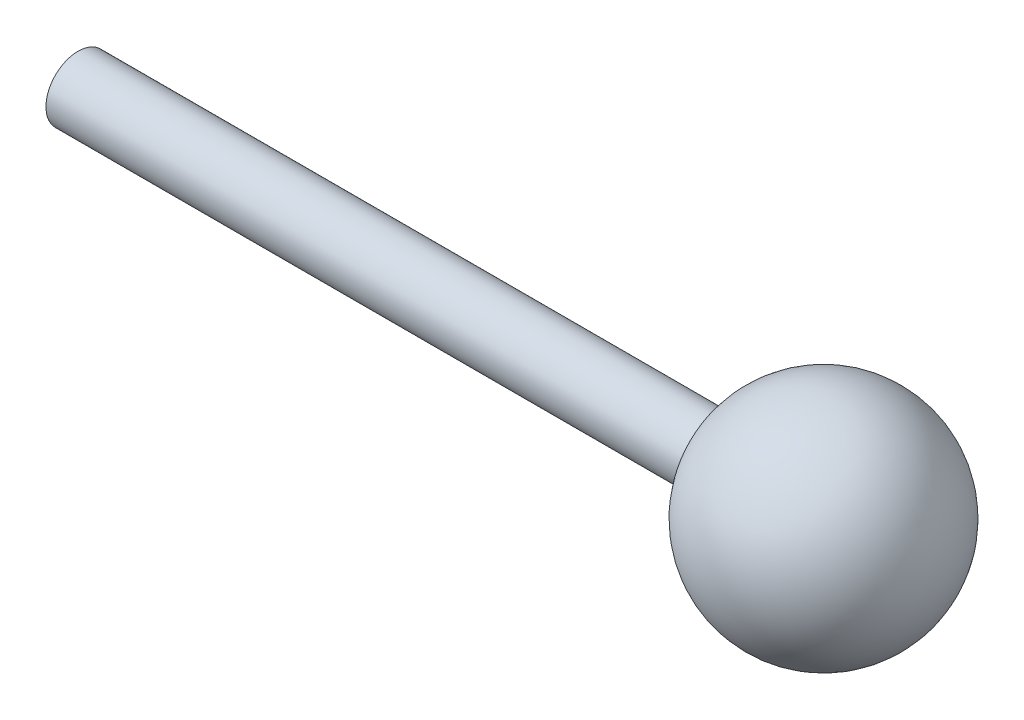
ISO-10303-21;
HEADER;
FILE_DESCRIPTION(('STEP AP214'),'2;1');
FILE_NAME('part.step','',(''),(''),'','','');
FILE_SCHEMA(('AUTOMOTIVE_DESIGN { 1 0 10303 214 1 1 1 1 }'));
ENDSEC;
DATA;
#1=APPLICATION_CONTEXT('core data for automotive mechanical design processes');
#2=APPLICATION_PROTOCOL_DEFINITION('international standard','automotive_design',2000,#1);
#3=PRODUCT_CONTEXT('',#1,'mechanical');
#4=PRODUCT('Part','Part','',(#3));
#5=PRODUCT_RELATED_PRODUCT_CATEGORY('part','',(#4));
#6=PRODUCT_DEFINITION_FORMATION('','',#4);
#7=PRODUCT_DEFINITION_CONTEXT('part definition',#1,'design');
#8=PRODUCT_DEFINITION('design','',#6,#7);
#9=PRODUCT_DEFINITION_SHAPE('','',#8);
#10=(LENGTH_UNIT() NAMED_UNIT(*) SI_UNIT(.MILLI.,.METRE.));
#11=(NAMED_UNIT(*) PLANE_ANGLE_UNIT() SI_UNIT($,.RADIAN.));
#12=(NAMED_UNIT(*) SI_UNIT($,.STERADIAN.) SOLID_ANGLE_UNIT());
#13=UNCERTAINTY_MEASURE_WITH_UNIT(LENGTH_MEASURE(1.E-05),#10,'distance_accuracy_value','');
#14=(GEOMETRIC_REPRESENTATION_CONTEXT(3) GLOBAL_UNCERTAINTY_ASSIGNED_CONTEXT((#13)) GLOBAL_UNIT_ASSIGNED_CONTEXT((#10,
#11,#12)) REPRESENTATION_CONTEXT('',''));
#15=CARTESIAN_POINT('',(0.,0.,0.));
#16=DIRECTION('',(0.,0.,1.));
#17=DIRECTION('',(1.,0.,0.));
#18=AXIS2_PLACEMENT_3D('',#15,#16,#17);
#19=CARTESIAN_POINT('',(15.,14.9726626100346,31.7841913266079));
#20=DIRECTION('',(-1.,0.,0.));
#21=DIRECTION('',(0.,0.,1.));
#22=AXIS2_PLACEMENT_3D('',#19,#20,#21);
#23=CYLINDRICAL_SURFACE('',#22,0.750000000000002);
#24=CARTESIAN_POINT('',(15.,14.9726626100346,31.7841913266079));
#25=DIRECTION('',(1.,0.,0.));
#26=DIRECTION('',(0.,0.,-1.));
#27=AXIS2_PLACEMENT_3D('',#24,#25,#26);
#28=CIRCLE('',#27,0.750000000000002);
#29=CARTESIAN_POINT('',(15.,14.9726626100346,31.0341913266079));
#30=VERTEX_POINT('',#29);
#31=EDGE_CURVE('E10',#30,#30,#28,.T.);
#32=ORIENTED_EDGE('',*,*,#31,.F.);
#33=EDGE_LOOP('',(#32));
#34=FACE_BOUND('',#33,.T.);
#35=CARTESIAN_POINT('',(0.,14.9726626100346,31.7841913266079));
#36=DIRECTION('',(1.,0.,0.));
#37=DIRECTION('',(0.,0.,-1.));
#38=AXIS2_PLACEMENT_3D('',#35,#36,#37);
#39=CIRCLE('',#38,0.750000000000002);
#40=CARTESIAN_POINT('',(0.,14.9726626100346,31.0341913266079));
#41=VERTEX_POINT('',#40);
#42=EDGE_CURVE('E39',#41,#41,#39,.T.);
#43=ORIENTED_EDGE('',*,*,#42,.T.);
#44=EDGE_LOOP('',(#43));
#45=FACE_BOUND('',#44,.T.);
#46=ADVANCED_FACE('F32',(#34,#45),#23,.T.);
#47=CARTESIAN_POINT('',(17.44375,14.9726626100346,31.7841913266079));
#48=DIRECTION('',(0.,0.,1.));
#49=DIRECTION('',(1.,0.,0.));
#50=AXIS2_PLACEMENT_3D('',#47,#48,#49);
#51=SPHERICAL_SURFACE('',#50,2.55625);
#52=CARTESIAN_POINT('',(17.44375,14.9726626100346,31.7841913266079));
#53=DIRECTION('',(1.,0.,0.));
#54=DIRECTION('',(0.,0.,-1.));
#55=AXIS2_PLACEMENT_3D('',#52,#53,#54);
#56=SPHERICAL_SURFACE('',#55,2.55625);
#57=ORIENTED_EDGE('',*,*,#31,.T.);
#58=EDGE_LOOP('',(#57));
#59=FACE_BOUND('',#58,.T.);
#60=ADVANCED_FACE('F34',(#59),#56,.T.);
#61=CARTESIAN_POINT('',(0.,14.9726626100346,31.7841913266079));
#62=DIRECTION('',(1.,0.,0.));
#63=DIRECTION('',(0.,0.,-1.));
#64=AXIS2_PLACEMENT_3D('',#61,#62,#63);
#65=PLANE('',#64);
#66=ORIENTED_EDGE('',*,*,#42,.F.);
#67=EDGE_LOOP('',(#66));
#68=FACE_BOUND('',#67,.T.);
#69=ADVANCED_FACE('F46',(#68),#65,.F.);
#70=CLOSED_SHELL('',(#46,#60,#69));
#71=MANIFOLD_SOLID_BREP('B2',#70);
#72=ADVANCED_BREP_SHAPE_REPRESENTATION('',(#18,#71),#14);
#73=SHAPE_DEFINITION_REPRESENTATION(#9,#72);
ENDSEC;
END-ISO-10303-21;
